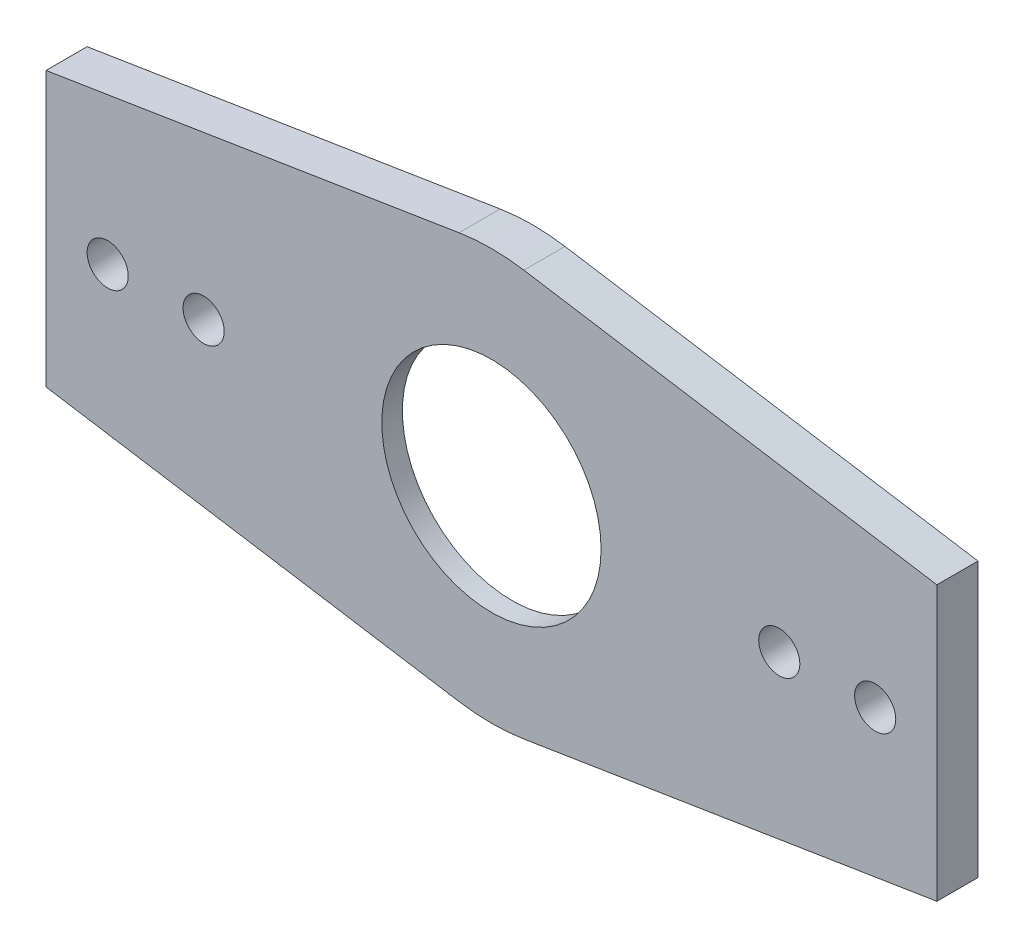
ISO-10303-21;
HEADER;
FILE_DESCRIPTION(('STEP AP214'),'2;1');
FILE_NAME('part.step','',(''),(''),'','','');
FILE_SCHEMA(('AUTOMOTIVE_DESIGN { 1 0 10303 214 1 1 1 1 }'));
ENDSEC;
DATA;
#1=APPLICATION_CONTEXT('core data for automotive mechanical design processes');
#2=APPLICATION_PROTOCOL_DEFINITION('international standard','automotive_design',2000,#1);
#3=PRODUCT_CONTEXT('',#1,'mechanical');
#4=PRODUCT('Part','Part','',(#3));
#5=PRODUCT_RELATED_PRODUCT_CATEGORY('part','',(#4));
#6=PRODUCT_DEFINITION_FORMATION('','',#4);
#7=PRODUCT_DEFINITION_CONTEXT('part definition',#1,'design');
#8=PRODUCT_DEFINITION('design','',#6,#7);
#9=PRODUCT_DEFINITION_SHAPE('','',#8);
#10=(LENGTH_UNIT() NAMED_UNIT(*) SI_UNIT(.MILLI.,.METRE.));
#11=(NAMED_UNIT(*) PLANE_ANGLE_UNIT() SI_UNIT($,.RADIAN.));
#12=(NAMED_UNIT(*) SI_UNIT($,.STERADIAN.) SOLID_ANGLE_UNIT());
#13=UNCERTAINTY_MEASURE_WITH_UNIT(LENGTH_MEASURE(1.E-05),#10,'distance_accuracy_value','');
#14=(GEOMETRIC_REPRESENTATION_CONTEXT(3) GLOBAL_UNCERTAINTY_ASSIGNED_CONTEXT((#13)) GLOBAL_UNIT_ASSIGNED_CONTEXT((#10,
#11,#12)) REPRESENTATION_CONTEXT('',''));
#15=CARTESIAN_POINT('',(0.,0.,0.));
#16=DIRECTION('',(0.,0.,1.));
#17=DIRECTION('',(1.,0.,0.));
#18=AXIS2_PLACEMENT_3D('',#15,#16,#17);
#19=CARTESIAN_POINT('',(0.,0.,3.));
#20=DIRECTION('',(0.,0.,-1.));
#21=DIRECTION('',(-1.,0.,0.));
#22=AXIS2_PLACEMENT_3D('',#19,#20,#21);
#23=CYLINDRICAL_SURFACE('',#22,30.);
#24=CARTESIAN_POINT('',(0.,0.,-3.));
#25=DIRECTION('',(0.,0.,-1.));
#26=DIRECTION('',(-1.,0.,0.));
#27=AXIS2_PLACEMENT_3D('',#24,#25,#26);
#28=CIRCLE('',#27,30.);
#29=CARTESIAN_POINT('',(4.73088284384847,-29.6246307574927,-3.));
#30=VERTEX_POINT('',#29);
#31=CARTESIAN_POINT('',(-4.7308828438484,-29.6246307574927,-3.));
#32=VERTEX_POINT('',#31);
#33=EDGE_CURVE('E193',#30,#32,#28,.T.);
#34=ORIENTED_EDGE('',*,*,#33,.F.);
#35=DIRECTION('',(0.,0.,-1.));
#36=VECTOR('',#35,1.);
#37=CARTESIAN_POINT('',(4.73088284384843,-29.6246307574927,3.));
#38=LINE('',#37,#36);
#39=CARTESIAN_POINT('',(4.73088284384843,-29.6246307574927,3.));
#40=VERTEX_POINT('',#39);
#41=EDGE_CURVE('E122',#40,#30,#38,.T.);
#42=ORIENTED_EDGE('',*,*,#41,.F.);
#43=CARTESIAN_POINT('',(0.,0.,3.));
#44=DIRECTION('',(0.,0.,1.));
#45=DIRECTION('',(1.,0.,0.));
#46=AXIS2_PLACEMENT_3D('',#43,#44,#45);
#47=CIRCLE('',#46,30.);
#48=CARTESIAN_POINT('',(-4.73088284384841,-29.6246307574927,3.));
#49=VERTEX_POINT('',#48);
#50=EDGE_CURVE('E180',#49,#40,#47,.T.);
#51=ORIENTED_EDGE('',*,*,#50,.F.);
#52=DIRECTION('',(0.,0.,-1.));
#53=VECTOR('',#52,1.);
#54=CARTESIAN_POINT('',(-4.73088284384841,-29.6246307574927,3.));
#55=LINE('',#54,#53);
#56=EDGE_CURVE('E129',#49,#32,#55,.T.);
#57=ORIENTED_EDGE('',*,*,#56,.T.);
#58=EDGE_LOOP('',(#34,#42,#51,#57));
#59=FACE_BOUND('',#58,.T.);
#60=ADVANCED_FACE('F37',(#59),#23,.T.);
#61=CARTESIAN_POINT('',(-65.,20.,3.));
#62=DIRECTION('',(0.157696094794948,-0.987487691916422,0.));
#63=DIRECTION('',(0.987487691916422,0.157696094794948,0.));
#64=AXIS2_PLACEMENT_3D('',#61,#62,#63);
#65=PLANE('',#64);
#66=DIRECTION('',(0.987487691916422,0.157696094794947,0.));
#67=VECTOR('',#66,1.);
#68=CARTESIAN_POINT('',(-65.,20.,-3.));
#69=LINE('',#68,#67);
#70=CARTESIAN_POINT('',(-65.,20.,-3.));
#71=VERTEX_POINT('',#70);
#72=CARTESIAN_POINT('',(-4.73088284384843,29.6246307574927,-3.));
#73=VERTEX_POINT('',#72);
#74=EDGE_CURVE('E146',#71,#73,#69,.T.);
#75=ORIENTED_EDGE('',*,*,#74,.F.);
#76=DIRECTION('',(0.,0.,-1.));
#77=VECTOR('',#76,1.);
#78=CARTESIAN_POINT('',(-65.,20.,3.));
#79=LINE('',#78,#77);
#80=CARTESIAN_POINT('',(-65.,20.,3.));
#81=VERTEX_POINT('',#80);
#82=EDGE_CURVE('E45',#81,#71,#79,.T.);
#83=ORIENTED_EDGE('',*,*,#82,.F.);
#84=DIRECTION('',(-0.987487691916422,-0.157696094794948,0.));
#85=VECTOR('',#84,1.);
#86=CARTESIAN_POINT('',(-65.,20.,3.));
#87=LINE('',#86,#85);
#88=CARTESIAN_POINT('',(-4.73088284384843,29.6246307574927,3.));
#89=VERTEX_POINT('',#88);
#90=EDGE_CURVE('E145',#89,#81,#87,.T.);
#91=ORIENTED_EDGE('',*,*,#90,.F.);
#92=DIRECTION('',(0.,0.,-1.));
#93=VECTOR('',#92,1.);
#94=CARTESIAN_POINT('',(-4.73088284384843,29.6246307574927,3.));
#95=LINE('',#94,#93);
#96=EDGE_CURVE('E11',#89,#73,#95,.T.);
#97=ORIENTED_EDGE('',*,*,#96,.T.);
#98=EDGE_LOOP('',(#75,#83,#91,#97));
#99=FACE_BOUND('',#98,.T.);
#100=ADVANCED_FACE('F39',(#99),#65,.F.);
#101=CARTESIAN_POINT('',(-65.,20.,3.));
#102=DIRECTION('',(1.,0.,0.));
#103=DIRECTION('',(0.,1.,0.));
#104=AXIS2_PLACEMENT_3D('',#101,#102,#103);
#105=PLANE('',#104);
#106=DIRECTION('',(0.,1.,0.));
#107=VECTOR('',#106,1.);
#108=CARTESIAN_POINT('',(-65.,-20.,-3.));
#109=LINE('',#108,#107);
#110=CARTESIAN_POINT('',(-65.,-20.,-3.));
#111=VERTEX_POINT('',#110);
#112=EDGE_CURVE('E141',#111,#71,#109,.T.);
#113=ORIENTED_EDGE('',*,*,#112,.F.);
#114=DIRECTION('',(0.,0.,-1.));
#115=VECTOR('',#114,1.);
#116=CARTESIAN_POINT('',(-65.,-20.,3.));
#117=LINE('',#116,#115);
#118=CARTESIAN_POINT('',(-65.,-20.,3.));
#119=VERTEX_POINT('',#118);
#120=EDGE_CURVE('E132',#119,#111,#117,.T.);
#121=ORIENTED_EDGE('',*,*,#120,.F.);
#122=DIRECTION('',(0.,-1.,0.));
#123=VECTOR('',#122,1.);
#124=CARTESIAN_POINT('',(-65.,20.,3.));
#125=LINE('',#124,#123);
#126=EDGE_CURVE('E142',#81,#119,#125,.T.);
#127=ORIENTED_EDGE('',*,*,#126,.F.);
#128=ORIENTED_EDGE('',*,*,#82,.T.);
#129=EDGE_LOOP('',(#113,#121,#127,#128));
#130=FACE_BOUND('',#129,.T.);
#131=ADVANCED_FACE('F139',(#130),#105,.F.);
#132=CARTESIAN_POINT('',(-65.,-20.,3.));
#133=DIRECTION('',(0.157696094794947,0.987487691916422,0.));
#134=DIRECTION('',(-0.987487691916422,0.157696094794947,0.));
#135=AXIS2_PLACEMENT_3D('',#132,#133,#134);
#136=PLANE('',#135);
#137=DIRECTION('',(-0.987487691916422,0.157696094794947,0.));
#138=VECTOR('',#137,1.);
#139=CARTESIAN_POINT('',(-4.7308828438484,-29.6246307574927,-3.));
#140=LINE('',#139,#138);
#141=EDGE_CURVE('E153',#32,#111,#140,.T.);
#142=ORIENTED_EDGE('',*,*,#141,.F.);
#143=ORIENTED_EDGE('',*,*,#56,.F.);
#144=DIRECTION('',(0.987487691916422,-0.157696094794947,0.));
#145=VECTOR('',#144,1.);
#146=CARTESIAN_POINT('',(-65.,-20.,3.));
#147=LINE('',#146,#145);
#148=EDGE_CURVE('E178',#119,#49,#147,.T.);
#149=ORIENTED_EDGE('',*,*,#148,.F.);
#150=ORIENTED_EDGE('',*,*,#120,.T.);
#151=EDGE_LOOP('',(#142,#143,#149,#150));
#152=FACE_BOUND('',#151,.T.);
#153=ADVANCED_FACE('F199',(#152),#136,.F.);
#154=CARTESIAN_POINT('',(0.,0.,-3.));
#155=DIRECTION('',(0.,0.,-1.));
#156=DIRECTION('',(-1.,0.,0.));
#157=AXIS2_PLACEMENT_3D('',#154,#155,#156);
#158=CIRCLE('',#157,30.);
#159=CARTESIAN_POINT('',(4.73088284384843,29.6246307574927,-3.));
#160=VERTEX_POINT('',#159);
#161=EDGE_CURVE('E52',#73,#160,#158,.T.);
#162=ORIENTED_EDGE('',*,*,#161,.F.);
#163=ORIENTED_EDGE('',*,*,#96,.F.);
#164=CARTESIAN_POINT('',(0.,0.,3.));
#165=DIRECTION('',(0.,0.,1.));
#166=DIRECTION('',(1.,0.,0.));
#167=AXIS2_PLACEMENT_3D('',#164,#165,#166);
#168=CIRCLE('',#167,30.0000000000001);
#169=CARTESIAN_POINT('',(4.73088284384843,29.6246307574927,3.));
#170=VERTEX_POINT('',#169);
#171=EDGE_CURVE('E174',#170,#89,#168,.T.);
#172=ORIENTED_EDGE('',*,*,#171,.F.);
#173=DIRECTION('',(0.,0.,-1.));
#174=VECTOR('',#173,1.);
#175=CARTESIAN_POINT('',(4.73088284384843,29.6246307574927,3.));
#176=LINE('',#175,#174);
#177=EDGE_CURVE('E120',#170,#160,#176,.T.);
#178=ORIENTED_EDGE('',*,*,#177,.T.);
#179=EDGE_LOOP('',(#162,#163,#172,#178));
#180=FACE_BOUND('',#179,.T.);
#181=ADVANCED_FACE('F204',(#180),#23,.T.);
#182=CARTESIAN_POINT('',(65.,-19.9999999999999,3.));
#183=DIRECTION('',(-0.157696094794948,0.987487691916422,0.));
#184=DIRECTION('',(-0.987487691916422,-0.157696094794948,0.));
#185=AXIS2_PLACEMENT_3D('',#182,#183,#184);
#186=PLANE('',#185);
#187=DIRECTION('',(-0.987487691916422,-0.157696094794949,0.));
#188=VECTOR('',#187,1.);
#189=CARTESIAN_POINT('',(65.,-19.9999999999999,-3.));
#190=LINE('',#189,#188);
#191=CARTESIAN_POINT('',(65.,-19.9999999999999,-3.));
#192=VERTEX_POINT('',#191);
#193=EDGE_CURVE('E117',#192,#30,#190,.T.);
#194=ORIENTED_EDGE('',*,*,#193,.F.);
#195=DIRECTION('',(0.,0.,-1.));
#196=VECTOR('',#195,1.);
#197=CARTESIAN_POINT('',(65.,-19.9999999999999,3.));
#198=LINE('',#197,#196);
#199=CARTESIAN_POINT('',(65.,-19.9999999999999,3.));
#200=VERTEX_POINT('',#199);
#201=EDGE_CURVE('E116',#200,#192,#198,.T.);
#202=ORIENTED_EDGE('',*,*,#201,.F.);
#203=DIRECTION('',(0.987487691916422,0.157696094794948,0.));
#204=VECTOR('',#203,1.);
#205=CARTESIAN_POINT('',(65.,-19.9999999999999,3.));
#206=LINE('',#205,#204);
#207=EDGE_CURVE('E182',#40,#200,#206,.T.);
#208=ORIENTED_EDGE('',*,*,#207,.F.);
#209=ORIENTED_EDGE('',*,*,#41,.T.);
#210=EDGE_LOOP('',(#194,#202,#208,#209));
#211=FACE_BOUND('',#210,.T.);
#212=ADVANCED_FACE('F191',(#211),#186,.F.);
#213=CARTESIAN_POINT('',(65.,20.,3.));
#214=DIRECTION('',(-1.,0.,0.));
#215=DIRECTION('',(0.,-1.,0.));
#216=AXIS2_PLACEMENT_3D('',#213,#214,#215);
#217=PLANE('',#216);
#218=DIRECTION('',(0.,-1.,0.));
#219=VECTOR('',#218,1.);
#220=CARTESIAN_POINT('',(65.,20.,-3.));
#221=LINE('',#220,#219);
#222=CARTESIAN_POINT('',(65.,20.,-3.));
#223=VERTEX_POINT('',#222);
#224=EDGE_CURVE('E103',#223,#192,#221,.T.);
#225=ORIENTED_EDGE('',*,*,#224,.F.);
#226=DIRECTION('',(0.,0.,-1.));
#227=VECTOR('',#226,1.);
#228=CARTESIAN_POINT('',(65.,20.,3.));
#229=LINE('',#228,#227);
#230=CARTESIAN_POINT('',(65.,20.,3.));
#231=VERTEX_POINT('',#230);
#232=EDGE_CURVE('E114',#231,#223,#229,.T.);
#233=ORIENTED_EDGE('',*,*,#232,.F.);
#234=DIRECTION('',(0.,1.,0.));
#235=VECTOR('',#234,1.);
#236=CARTESIAN_POINT('',(65.,20.,3.));
#237=LINE('',#236,#235);
#238=EDGE_CURVE('E184',#200,#231,#237,.T.);
#239=ORIENTED_EDGE('',*,*,#238,.F.);
#240=ORIENTED_EDGE('',*,*,#201,.T.);
#241=EDGE_LOOP('',(#225,#233,#239,#240));
#242=FACE_BOUND('',#241,.T.);
#243=ADVANCED_FACE('F112',(#242),#217,.F.);
#244=CARTESIAN_POINT('',(65.,20.,3.));
#245=DIRECTION('',(-0.157696094794948,-0.987487691916422,0.));
#246=DIRECTION('',(0.987487691916422,-0.157696094794948,0.));
#247=AXIS2_PLACEMENT_3D('',#244,#245,#246);
#248=PLANE('',#247);
#249=DIRECTION('',(0.987487691916422,-0.157696094794947,0.));
#250=VECTOR('',#249,1.);
#251=CARTESIAN_POINT('',(4.73088284384843,29.6246307574927,-3.));
#252=LINE('',#251,#250);
#253=EDGE_CURVE('E100',#160,#223,#252,.T.);
#254=ORIENTED_EDGE('',*,*,#253,.F.);
#255=ORIENTED_EDGE('',*,*,#177,.F.);
#256=DIRECTION('',(-0.987487691916422,0.157696094794948,0.));
#257=VECTOR('',#256,1.);
#258=CARTESIAN_POINT('',(65.,20.,3.));
#259=LINE('',#258,#257);
#260=EDGE_CURVE('E60',#231,#170,#259,.T.);
#261=ORIENTED_EDGE('',*,*,#260,.F.);
#262=ORIENTED_EDGE('',*,*,#232,.T.);
#263=EDGE_LOOP('',(#254,#255,#261,#262));
#264=FACE_BOUND('',#263,.T.);
#265=ADVANCED_FACE('F119',(#264),#248,.F.);
#266=CARTESIAN_POINT('',(56.,0.,3.));
#267=DIRECTION('',(0.,0.,-1.));
#268=DIRECTION('',(-1.,0.,0.));
#269=AXIS2_PLACEMENT_3D('',#266,#267,#268);
#270=CYLINDRICAL_SURFACE('',#269,3.00000000000001);
#271=CARTESIAN_POINT('',(56.,0.,3.));
#272=DIRECTION('',(0.,0.,1.));
#273=DIRECTION('',(1.,0.,0.));
#274=AXIS2_PLACEMENT_3D('',#271,#272,#273);
#275=CIRCLE('',#274,3.00000000000001);
#276=CARTESIAN_POINT('',(59.,0.,3.));
#277=VERTEX_POINT('',#276);
#278=EDGE_CURVE('E171',#277,#277,#275,.T.);
#279=ORIENTED_EDGE('',*,*,#278,.T.);
#280=EDGE_LOOP('',(#279));
#281=FACE_BOUND('',#280,.T.);
#282=CARTESIAN_POINT('',(56.,0.,-3.));
#283=DIRECTION('',(0.,0.,-1.));
#284=DIRECTION('',(-1.,0.,0.));
#285=AXIS2_PLACEMENT_3D('',#282,#283,#284);
#286=CIRCLE('',#285,3.00000000000001);
#287=CARTESIAN_POINT('',(53.,0.,-3.));
#288=VERTEX_POINT('',#287);
#289=EDGE_CURVE('E231',#288,#288,#286,.T.);
#290=ORIENTED_EDGE('',*,*,#289,.T.);
#291=EDGE_LOOP('',(#290));
#292=FACE_BOUND('',#291,.T.);
#293=ADVANCED_FACE('F235',(#281,#292),#270,.F.);
#294=CARTESIAN_POINT('',(42.,0.,3.));
#295=DIRECTION('',(0.,0.,-1.));
#296=DIRECTION('',(-1.,0.,0.));
#297=AXIS2_PLACEMENT_3D('',#294,#295,#296);
#298=CYLINDRICAL_SURFACE('',#297,3.);
#299=CARTESIAN_POINT('',(42.,0.,3.));
#300=DIRECTION('',(0.,0.,1.));
#301=DIRECTION('',(1.,0.,0.));
#302=AXIS2_PLACEMENT_3D('',#299,#300,#301);
#303=CIRCLE('',#302,3.);
#304=CARTESIAN_POINT('',(45.,0.,3.));
#305=VERTEX_POINT('',#304);
#306=EDGE_CURVE('E168',#305,#305,#303,.T.);
#307=ORIENTED_EDGE('',*,*,#306,.T.);
#308=EDGE_LOOP('',(#307));
#309=FACE_BOUND('',#308,.T.);
#310=CARTESIAN_POINT('',(42.,0.,-3.));
#311=DIRECTION('',(0.,0.,-1.));
#312=DIRECTION('',(-1.,0.,0.));
#313=AXIS2_PLACEMENT_3D('',#310,#311,#312);
#314=CIRCLE('',#313,3.);
#315=CARTESIAN_POINT('',(39.,0.,-3.));
#316=VERTEX_POINT('',#315);
#317=EDGE_CURVE('E228',#316,#316,#314,.T.);
#318=ORIENTED_EDGE('',*,*,#317,.T.);
#319=EDGE_LOOP('',(#318));
#320=FACE_BOUND('',#319,.T.);
#321=ADVANCED_FACE('F252',(#309,#320),#298,.F.);
#322=CARTESIAN_POINT('',(-56.,0.,3.));
#323=DIRECTION('',(0.,0.,-1.));
#324=DIRECTION('',(-1.,0.,0.));
#325=AXIS2_PLACEMENT_3D('',#322,#323,#324);
#326=CYLINDRICAL_SURFACE('',#325,3.00000000000001);
#327=CARTESIAN_POINT('',(-56.,0.,3.));
#328=DIRECTION('',(0.,0.,1.));
#329=DIRECTION('',(-1.,0.,0.));
#330=AXIS2_PLACEMENT_3D('',#327,#328,#329);
#331=CIRCLE('',#330,3.00000000000001);
#332=CARTESIAN_POINT('',(-59.,0.,3.));
#333=VERTEX_POINT('',#332);
#334=EDGE_CURVE('E165',#333,#333,#331,.T.);
#335=ORIENTED_EDGE('',*,*,#334,.T.);
#336=EDGE_LOOP('',(#335));
#337=FACE_BOUND('',#336,.T.);
#338=CARTESIAN_POINT('',(-56.,0.,-3.));
#339=DIRECTION('',(0.,0.,-1.));
#340=DIRECTION('',(-1.,0.,0.));
#341=AXIS2_PLACEMENT_3D('',#338,#339,#340);
#342=CIRCLE('',#341,3.00000000000001);
#343=CARTESIAN_POINT('',(-59.,0.,-3.));
#344=VERTEX_POINT('',#343);
#345=EDGE_CURVE('E217',#344,#344,#342,.T.);
#346=ORIENTED_EDGE('',*,*,#345,.T.);
#347=EDGE_LOOP('',(#346));
#348=FACE_BOUND('',#347,.T.);
#349=ADVANCED_FACE('F249',(#337,#348),#326,.F.);
#350=CARTESIAN_POINT('',(-42.,0.,3.));
#351=DIRECTION('',(0.,0.,-1.));
#352=DIRECTION('',(-1.,0.,0.));
#353=AXIS2_PLACEMENT_3D('',#350,#351,#352);
#354=CYLINDRICAL_SURFACE('',#353,3.);
#355=CARTESIAN_POINT('',(-42.,0.,3.));
#356=DIRECTION('',(0.,0.,1.));
#357=DIRECTION('',(-1.,0.,0.));
#358=AXIS2_PLACEMENT_3D('',#355,#356,#357);
#359=CIRCLE('',#358,3.);
#360=CARTESIAN_POINT('',(-45.,0.,3.));
#361=VERTEX_POINT('',#360);
#362=EDGE_CURVE('E160',#361,#361,#359,.T.);
#363=ORIENTED_EDGE('',*,*,#362,.T.);
#364=EDGE_LOOP('',(#363));
#365=FACE_BOUND('',#364,.T.);
#366=CARTESIAN_POINT('',(-42.,0.,-3.));
#367=DIRECTION('',(0.,0.,-1.));
#368=DIRECTION('',(-1.,0.,0.));
#369=AXIS2_PLACEMENT_3D('',#366,#367,#368);
#370=CIRCLE('',#369,3.);
#371=CARTESIAN_POINT('',(-45.,0.,-3.));
#372=VERTEX_POINT('',#371);
#373=EDGE_CURVE('E220',#372,#372,#370,.T.);
#374=ORIENTED_EDGE('',*,*,#373,.T.);
#375=EDGE_LOOP('',(#374));
#376=FACE_BOUND('',#375,.T.);
#377=ADVANCED_FACE('F251',(#365,#376),#354,.F.);
#378=CARTESIAN_POINT('',(0.,0.,-3.5));
#379=DIRECTION('',(0.,0.,1.));
#380=DIRECTION('',(1.,0.,0.));
#381=AXIS2_PLACEMENT_3D('',#378,#379,#380);
#382=CYLINDRICAL_SURFACE('',#381,21.);
#383=CARTESIAN_POINT('',(0.,0.,0.));
#384=DIRECTION('',(0.,0.,-1.));
#385=DIRECTION('',(-1.,0.,0.));
#386=AXIS2_PLACEMENT_3D('',#383,#384,#385);
#387=CIRCLE('',#386,21.);
#388=CARTESIAN_POINT('',(-21.,0.,0.));
#389=VERTEX_POINT('',#388);
#390=EDGE_CURVE('E148',#389,#389,#387,.T.);
#391=ORIENTED_EDGE('',*,*,#390,.F.);
#392=EDGE_LOOP('',(#391));
#393=FACE_BOUND('',#392,.T.);
#394=CARTESIAN_POINT('',(0.,0.,-3.));
#395=DIRECTION('',(0.,0.,-1.));
#396=DIRECTION('',(-1.,0.,0.));
#397=AXIS2_PLACEMENT_3D('',#394,#395,#396);
#398=CIRCLE('',#397,21.);
#399=CARTESIAN_POINT('',(-21.,0.,-3.));
#400=VERTEX_POINT('',#399);
#401=EDGE_CURVE('E225',#400,#400,#398,.T.);
#402=ORIENTED_EDGE('',*,*,#401,.T.);
#403=EDGE_LOOP('',(#402));
#404=FACE_BOUND('',#403,.T.);
#405=ADVANCED_FACE('F259',(#393,#404),#382,.F.);
#406=CARTESIAN_POINT('',(0.,0.,0.));
#407=DIRECTION('',(0.,0.,1.));
#408=DIRECTION('',(1.,0.,0.));
#409=AXIS2_PLACEMENT_3D('',#406,#407,#408);
#410=PLANE('',#409);
#411=CARTESIAN_POINT('',(0.,0.,0.));
#412=DIRECTION('',(0.,0.,1.));
#413=DIRECTION('',(1.,0.,0.));
#414=AXIS2_PLACEMENT_3D('',#411,#412,#413);
#415=CIRCLE('',#414,16.);
#416=CARTESIAN_POINT('',(16.,0.,0.));
#417=VERTEX_POINT('',#416);
#418=EDGE_CURVE('E151',#417,#417,#415,.T.);
#419=ORIENTED_EDGE('',*,*,#418,.T.);
#420=EDGE_LOOP('',(#419));
#421=FACE_BOUND('',#420,.T.);
#422=ORIENTED_EDGE('',*,*,#390,.T.);
#423=EDGE_LOOP('',(#422));
#424=FACE_BOUND('',#423,.T.);
#425=ADVANCED_FACE('F271',(#421,#424),#410,.F.);
#426=CARTESIAN_POINT('',(0.,0.,3.));
#427=DIRECTION('',(0.,0.,1.));
#428=DIRECTION('',(1.,0.,0.));
#429=AXIS2_PLACEMENT_3D('',#426,#427,#428);
#430=PLANE('',#429);
#431=ORIENTED_EDGE('',*,*,#362,.F.);
#432=EDGE_LOOP('',(#431));
#433=FACE_BOUND('',#432,.T.);
#434=ORIENTED_EDGE('',*,*,#306,.F.);
#435=EDGE_LOOP('',(#434));
#436=FACE_BOUND('',#435,.T.);
#437=ORIENTED_EDGE('',*,*,#171,.T.);
#438=ORIENTED_EDGE('',*,*,#90,.T.);
#439=ORIENTED_EDGE('',*,*,#126,.T.);
#440=ORIENTED_EDGE('',*,*,#148,.T.);
#441=ORIENTED_EDGE('',*,*,#50,.T.);
#442=ORIENTED_EDGE('',*,*,#207,.T.);
#443=ORIENTED_EDGE('',*,*,#238,.T.);
#444=ORIENTED_EDGE('',*,*,#260,.T.);
#445=EDGE_LOOP('',(#437,#438,#439,#440,#441,#442,#443,#444));
#446=FACE_BOUND('',#445,.T.);
#447=ORIENTED_EDGE('',*,*,#278,.F.);
#448=EDGE_LOOP('',(#447));
#449=FACE_BOUND('',#448,.T.);
#450=ORIENTED_EDGE('',*,*,#334,.F.);
#451=EDGE_LOOP('',(#450));
#452=FACE_BOUND('',#451,.T.);
#453=CARTESIAN_POINT('',(0.,0.,3.));
#454=DIRECTION('',(0.,0.,1.));
#455=DIRECTION('',(1.,0.,0.));
#456=AXIS2_PLACEMENT_3D('',#453,#454,#455);
#457=CIRCLE('',#456,16.);
#458=CARTESIAN_POINT('',(16.,0.,3.));
#459=VERTEX_POINT('',#458);
#460=EDGE_CURVE('E157',#459,#459,#457,.T.);
#461=ORIENTED_EDGE('',*,*,#460,.F.);
#462=EDGE_LOOP('',(#461));
#463=FACE_BOUND('',#462,.T.);
#464=ADVANCED_FACE('F185',(#433,#436,#446,#449,#452,#463),#430,.T.);
#465=CARTESIAN_POINT('',(0.,0.,3.));
#466=DIRECTION('',(0.,0.,-1.));
#467=DIRECTION('',(-1.,0.,0.));
#468=AXIS2_PLACEMENT_3D('',#465,#466,#467);
#469=CYLINDRICAL_SURFACE('',#468,16.);
#470=ORIENTED_EDGE('',*,*,#460,.T.);
#471=EDGE_LOOP('',(#470));
#472=FACE_BOUND('',#471,.T.);
#473=ORIENTED_EDGE('',*,*,#418,.F.);
#474=EDGE_LOOP('',(#473));
#475=FACE_BOUND('',#474,.T.);
#476=ADVANCED_FACE('F239',(#472,#475),#469,.F.);
#477=CARTESIAN_POINT('',(0.,0.,-3.));
#478=DIRECTION('',(0.,0.,-1.));
#479=DIRECTION('',(-1.,0.,0.));
#480=AXIS2_PLACEMENT_3D('',#477,#478,#479);
#481=PLANE('',#480);
#482=ORIENTED_EDGE('',*,*,#289,.F.);
#483=EDGE_LOOP('',(#482));
#484=FACE_BOUND('',#483,.T.);
#485=ORIENTED_EDGE('',*,*,#317,.F.);
#486=EDGE_LOOP('',(#485));
#487=FACE_BOUND('',#486,.T.);
#488=ORIENTED_EDGE('',*,*,#401,.F.);
#489=EDGE_LOOP('',(#488));
#490=FACE_BOUND('',#489,.T.);
#491=ORIENTED_EDGE('',*,*,#373,.F.);
#492=EDGE_LOOP('',(#491));
#493=FACE_BOUND('',#492,.T.);
#494=ORIENTED_EDGE('',*,*,#345,.F.);
#495=EDGE_LOOP('',(#494));
#496=FACE_BOUND('',#495,.T.);
#497=ORIENTED_EDGE('',*,*,#161,.T.);
#498=ORIENTED_EDGE('',*,*,#253,.T.);
#499=ORIENTED_EDGE('',*,*,#224,.T.);
#500=ORIENTED_EDGE('',*,*,#193,.T.);
#501=ORIENTED_EDGE('',*,*,#33,.T.);
#502=ORIENTED_EDGE('',*,*,#141,.T.);
#503=ORIENTED_EDGE('',*,*,#112,.T.);
#504=ORIENTED_EDGE('',*,*,#74,.T.);
#505=EDGE_LOOP('',(#497,#498,#499,#500,#501,#502,#503,#504));
#506=FACE_BOUND('',#505,.T.);
#507=ADVANCED_FACE('F102',(#484,#487,#490,#493,#496,#506),#481,.T.);
#508=CLOSED_SHELL('',(#60,#100,#131,#153,#181,#212,#243,#265,#293,#321,#349,#377,#405,#425,#464,
#476,#507));
#509=MANIFOLD_SOLID_BREP('B2',#508);
#510=ADVANCED_BREP_SHAPE_REPRESENTATION('',(#18,#509),#14);
#511=SHAPE_DEFINITION_REPRESENTATION(#9,#510);
ENDSEC;
END-ISO-10303-21;
